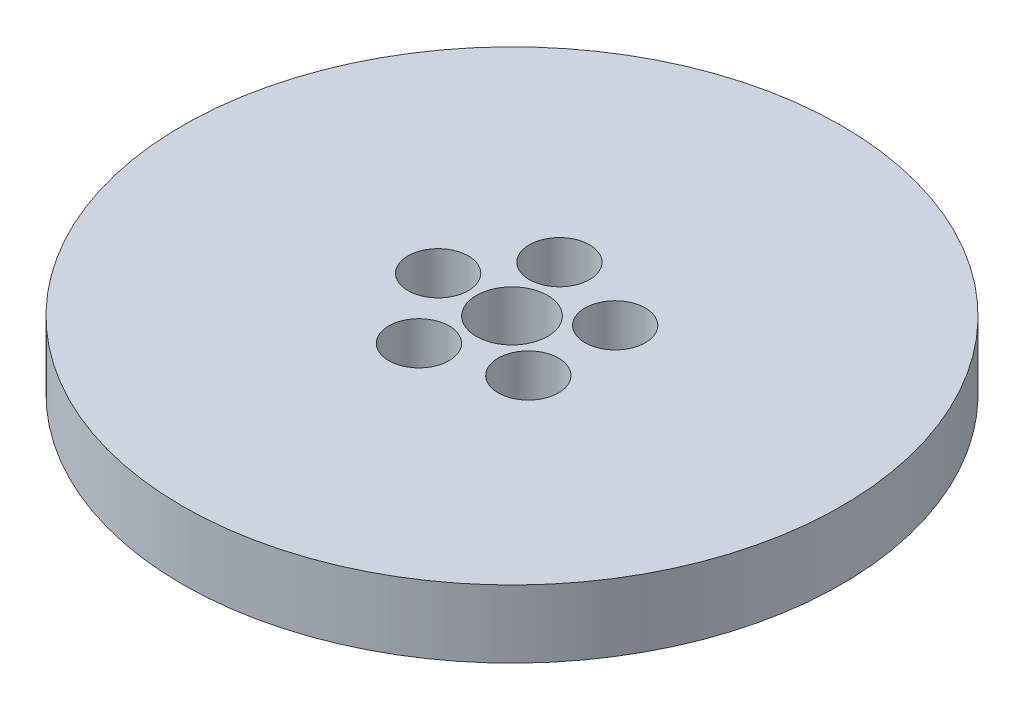
ISO-10303-21;
HEADER;
FILE_DESCRIPTION(('STEP AP214'),'2;1');
FILE_NAME('part.step','',(''),(''),'','','');
FILE_SCHEMA(('AUTOMOTIVE_DESIGN { 1 0 10303 214 1 1 1 1 }'));
ENDSEC;
DATA;
#1=APPLICATION_CONTEXT('core data for automotive mechanical design processes');
#2=APPLICATION_PROTOCOL_DEFINITION('international standard','automotive_design',2000,#1);
#3=PRODUCT_CONTEXT('',#1,'mechanical');
#4=PRODUCT('Part','Part','',(#3));
#5=PRODUCT_RELATED_PRODUCT_CATEGORY('part','',(#4));
#6=PRODUCT_DEFINITION_FORMATION('','',#4);
#7=PRODUCT_DEFINITION_CONTEXT('part definition',#1,'design');
#8=PRODUCT_DEFINITION('design','',#6,#7);
#9=PRODUCT_DEFINITION_SHAPE('','',#8);
#10=(LENGTH_UNIT() NAMED_UNIT(*) SI_UNIT(.MILLI.,.METRE.));
#11=(NAMED_UNIT(*) PLANE_ANGLE_UNIT() SI_UNIT($,.RADIAN.));
#12=(NAMED_UNIT(*) SI_UNIT($,.STERADIAN.) SOLID_ANGLE_UNIT());
#13=UNCERTAINTY_MEASURE_WITH_UNIT(LENGTH_MEASURE(1.E-05),#10,'distance_accuracy_value','');
#14=(GEOMETRIC_REPRESENTATION_CONTEXT(3) GLOBAL_UNCERTAINTY_ASSIGNED_CONTEXT((#13)) GLOBAL_UNIT_ASSIGNED_CONTEXT((#10,
#11,#12)) REPRESENTATION_CONTEXT('',''));
#15=CARTESIAN_POINT('',(0.,0.,0.));
#16=DIRECTION('',(0.,0.,1.));
#17=DIRECTION('',(1.,0.,0.));
#18=AXIS2_PLACEMENT_3D('',#15,#16,#17);
#19=CARTESIAN_POINT('',(0.,19.,0.));
#20=DIRECTION('',(0.,-1.,0.));
#21=DIRECTION('',(0.,0.,-1.));
#22=AXIS2_PLACEMENT_3D('',#19,#20,#21);
#23=CYLINDRICAL_SURFACE('',#22,92.5);
#24=CARTESIAN_POINT('',(0.,19.,0.));
#25=DIRECTION('',(0.,1.,0.));
#26=DIRECTION('',(0.,0.,1.));
#27=AXIS2_PLACEMENT_3D('',#24,#25,#26);
#28=CIRCLE('',#27,92.5);
#29=CARTESIAN_POINT('',(0.,19.,92.5));
#30=VERTEX_POINT('',#29);
#31=EDGE_CURVE('E10',#30,#30,#28,.T.);
#32=ORIENTED_EDGE('',*,*,#31,.F.);
#33=EDGE_LOOP('',(#32));
#34=FACE_BOUND('',#33,.T.);
#35=CARTESIAN_POINT('',(0.,0.,0.));
#36=DIRECTION('',(0.,1.,0.));
#37=DIRECTION('',(0.,0.,1.));
#38=AXIS2_PLACEMENT_3D('',#35,#36,#37);
#39=CIRCLE('',#38,92.5);
#40=CARTESIAN_POINT('',(0.,0.,92.5));
#41=VERTEX_POINT('',#40);
#42=EDGE_CURVE('E37',#41,#41,#39,.T.);
#43=ORIENTED_EDGE('',*,*,#42,.T.);
#44=EDGE_LOOP('',(#43));
#45=FACE_BOUND('',#44,.T.);
#46=ADVANCED_FACE('F40',(#34,#45),#23,.T.);
#47=CARTESIAN_POINT('',(0.,19.,0.));
#48=DIRECTION('',(0.,1.,0.));
#49=DIRECTION('',(0.,0.,1.));
#50=AXIS2_PLACEMENT_3D('',#47,#48,#49);
#51=PLANE('',#50);
#52=CARTESIAN_POINT('',(-6.40635530356194,19.,-19.7167342510672));
#53=DIRECTION('',(0.,1.,0.));
#54=DIRECTION('',(-0.95105651629515,0.,0.309016994374958));
#55=AXIS2_PLACEMENT_3D('',#52,#53,#54);
#56=CIRCLE('',#55,8.47070646672109);
#57=CARTESIAN_POINT('',(-6.40635530356194,19.,-11.2460277843461));
#58=VERTEX_POINT('',#57);
#59=EDGE_CURVE('E70',#58,#58,#56,.T.);
#60=ORIENTED_EDGE('',*,*,#59,.F.);
#61=EDGE_LOOP('',(#60));
#62=FACE_BOUND('',#61,.T.);
#63=CARTESIAN_POINT('',(16.7720559287326,19.,-12.1856119143089));
#64=DIRECTION('',(0.,1.,0.));
#65=DIRECTION('',(-0.58778525229248,0.,-0.809016994374942));
#66=AXIS2_PLACEMENT_3D('',#63,#64,#65);
#67=CIRCLE('',#66,8.47070646672109);
#68=CARTESIAN_POINT('',(16.7720559287326,19.,-3.71490544758783));
#69=VERTEX_POINT('',#68);
#70=EDGE_CURVE('E71',#69,#69,#67,.T.);
#71=ORIENTED_EDGE('',*,*,#70,.F.);
#72=EDGE_LOOP('',(#71));
#73=FACE_BOUND('',#72,.T.);
#74=CARTESIAN_POINT('',(16.7720559287328,19.,12.1856119143087));
#75=DIRECTION('',(0.,1.,0.));
#76=DIRECTION('',(0.587785252292469,0.,-0.809016994374951));
#77=AXIS2_PLACEMENT_3D('',#74,#75,#76);
#78=CIRCLE('',#77,8.47070646672109);
#79=CARTESIAN_POINT('',(16.7720559287328,19.,20.6563183810298));
#80=VERTEX_POINT('',#79);
#81=EDGE_CURVE('E78',#80,#80,#78,.T.);
#82=ORIENTED_EDGE('',*,*,#81,.F.);
#83=EDGE_LOOP('',(#82));
#84=FACE_BOUND('',#83,.T.);
#85=CARTESIAN_POINT('',(-6.40635530356166,19.,19.7167342510673));
#86=DIRECTION('',(0.,1.,0.));
#87=DIRECTION('',(0.951056516295155,0.,0.309016994374945));
#88=AXIS2_PLACEMENT_3D('',#85,#86,#87);
#89=CIRCLE('',#88,8.47070646672109);
#90=CARTESIAN_POINT('',(-6.40635530356166,19.,28.1874407177884));
#91=VERTEX_POINT('',#90);
#92=EDGE_CURVE('E61',#91,#91,#89,.T.);
#93=ORIENTED_EDGE('',*,*,#92,.F.);
#94=EDGE_LOOP('',(#93));
#95=FACE_BOUND('',#94,.T.);
#96=CARTESIAN_POINT('',(-20.731401250342,19.,0.));
#97=DIRECTION('',(0.,1.,0.));
#98=DIRECTION('',(0.,0.,1.));
#99=AXIS2_PLACEMENT_3D('',#96,#97,#98);
#100=CIRCLE('',#99,8.47070646672109);
#101=CARTESIAN_POINT('',(-20.731401250342,19.,8.47070646672109));
#102=VERTEX_POINT('',#101);
#103=EDGE_CURVE('E54',#102,#102,#100,.T.);
#104=ORIENTED_EDGE('',*,*,#103,.F.);
#105=EDGE_LOOP('',(#104));
#106=FACE_BOUND('',#105,.T.);
#107=CARTESIAN_POINT('',(0.,19.,0.));
#108=DIRECTION('',(0.,1.,0.));
#109=DIRECTION('',(0.,0.,1.));
#110=AXIS2_PLACEMENT_3D('',#107,#108,#109);
#111=CIRCLE('',#110,10.);
#112=CARTESIAN_POINT('',(0.,19.,10.));
#113=VERTEX_POINT('',#112);
#114=EDGE_CURVE('E50',#113,#113,#111,.T.);
#115=ORIENTED_EDGE('',*,*,#114,.F.);
#116=EDGE_LOOP('',(#115));
#117=FACE_BOUND('',#116,.T.);
#118=ORIENTED_EDGE('',*,*,#31,.T.);
#119=EDGE_LOOP('',(#118));
#120=FACE_BOUND('',#119,.T.);
#121=ADVANCED_FACE('F94',(#62,#73,#84,#95,#106,#117,#120),#51,.T.);
#122=CARTESIAN_POINT('',(0.,0.,0.));
#123=DIRECTION('',(0.,1.,0.));
#124=DIRECTION('',(0.,0.,1.));
#125=AXIS2_PLACEMENT_3D('',#122,#123,#124);
#126=PLANE('',#125);
#127=CARTESIAN_POINT('',(0.,0.,0.));
#128=DIRECTION('',(0.,1.,0.));
#129=DIRECTION('',(0.,0.,1.));
#130=AXIS2_PLACEMENT_3D('',#127,#128,#129);
#131=CIRCLE('',#130,10.);
#132=CARTESIAN_POINT('',(0.,0.,10.));
#133=VERTEX_POINT('',#132);
#134=EDGE_CURVE('E47',#133,#133,#131,.T.);
#135=ORIENTED_EDGE('',*,*,#134,.T.);
#136=EDGE_LOOP('',(#135));
#137=FACE_BOUND('',#136,.T.);
#138=ORIENTED_EDGE('',*,*,#42,.F.);
#139=EDGE_LOOP('',(#138));
#140=FACE_BOUND('',#139,.T.);
#141=ADVANCED_FACE('F100',(#137,#140),#126,.F.);
#142=CARTESIAN_POINT('',(0.,19.,0.));
#143=DIRECTION('',(0.,-1.,0.));
#144=DIRECTION('',(0.,0.,-1.));
#145=AXIS2_PLACEMENT_3D('',#142,#143,#144);
#146=CYLINDRICAL_SURFACE('',#145,10.);
#147=ORIENTED_EDGE('',*,*,#114,.T.);
#148=EDGE_LOOP('',(#147));
#149=FACE_BOUND('',#148,.T.);
#150=ORIENTED_EDGE('',*,*,#134,.F.);
#151=EDGE_LOOP('',(#150));
#152=FACE_BOUND('',#151,.T.);
#153=ADVANCED_FACE('F106',(#149,#152),#146,.F.);
#154=CARTESIAN_POINT('',(-20.731401250342,6.42580363866504,0.));
#155=DIRECTION('',(0.,1.,0.));
#156=DIRECTION('',(0.,0.,1.));
#157=AXIS2_PLACEMENT_3D('',#154,#155,#156);
#158=CYLINDRICAL_SURFACE('',#157,8.47070646672109);
#159=CARTESIAN_POINT('',(-20.731401250342,6.42580363866504,0.));
#160=DIRECTION('',(0.,1.,0.));
#161=DIRECTION('',(0.,0.,1.));
#162=AXIS2_PLACEMENT_3D('',#159,#160,#161);
#163=CIRCLE('',#162,8.47070646672109);
#164=CARTESIAN_POINT('',(-20.731401250342,6.42580363866504,8.47070646672109));
#165=VERTEX_POINT('',#164);
#166=EDGE_CURVE('E55',#165,#165,#163,.T.);
#167=CARTESIAN_POINT('',(-20.731401250342,6.42580363866504,8.47070646672109));
#168=CARTESIAN_POINT('',(-20.731401250342,6.55678485076228,8.47070646672109));
#169=CARTESIAN_POINT('',(-20.731401250342,6.68776606285952,8.47070646672109));
#170=CARTESIAN_POINT('',(-20.731401250342,6.949728487054,8.47070646672109));
#171=CARTESIAN_POINT('',(-20.731401250342,7.08070969915124,8.47070646672109));
#172=CARTESIAN_POINT('',(-20.731401250342,7.34267212334572,8.47070646672109));
#173=CARTESIAN_POINT('',(-20.731401250342,7.47365333544296,8.47070646672109));
#174=CARTESIAN_POINT('',(-20.731401250342,7.73561575963743,8.47070646672109));
#175=CARTESIAN_POINT('',(-20.731401250342,7.86659697173467,8.47070646672109));
#176=CARTESIAN_POINT('',(-20.731401250342,8.12855939592915,8.47070646672109));
#177=CARTESIAN_POINT('',(-20.731401250342,8.25954060802639,8.47070646672109));
#178=CARTESIAN_POINT('',(-20.731401250342,8.52150303222087,8.47070646672109));
#179=CARTESIAN_POINT('',(-20.731401250342,8.65248424431811,8.47070646672109));
#180=CARTESIAN_POINT('',(-20.731401250342,8.91444666851259,8.47070646672109));
#181=CARTESIAN_POINT('',(-20.731401250342,9.04542788060983,8.47070646672109));
#182=CARTESIAN_POINT('',(-20.731401250342,9.3073903048043,8.47070646672109));
#183=CARTESIAN_POINT('',(-20.731401250342,9.43837151690154,8.47070646672109));
#184=CARTESIAN_POINT('',(-20.731401250342,9.70033394109602,8.47070646672109));
#185=CARTESIAN_POINT('',(-20.731401250342,9.83131515319326,8.47070646672109));
#186=CARTESIAN_POINT('',(-20.731401250342,10.0932775773877,8.47070646672109));
#187=CARTESIAN_POINT('',(-20.731401250342,10.224258789485,8.47070646672109));
#188=CARTESIAN_POINT('',(-20.731401250342,10.4862212136795,8.47070646672109));
#189=CARTESIAN_POINT('',(-20.731401250342,10.6172024257767,8.47070646672109));
#190=CARTESIAN_POINT('',(-20.731401250342,10.8791648499712,8.47070646672109));
#191=CARTESIAN_POINT('',(-20.731401250342,11.0101460620684,8.47070646672109));
#192=CARTESIAN_POINT('',(-20.731401250342,11.2721084862629,8.47070646672109));
#193=CARTESIAN_POINT('',(-20.731401250342,11.4030896983601,8.47070646672109));
#194=CARTESIAN_POINT('',(-20.731401250342,11.6650521225546,8.47070646672109));
#195=CARTESIAN_POINT('',(-20.731401250342,11.7960333346518,8.47070646672109));
#196=CARTESIAN_POINT('',(-20.731401250342,12.0579957588463,8.47070646672109));
#197=CARTESIAN_POINT('',(-20.731401250342,12.1889769709436,8.47070646672109));
#198=CARTESIAN_POINT('',(-20.731401250342,12.450939395138,8.47070646672109));
#199=CARTESIAN_POINT('',(-20.731401250342,12.5819206072353,8.47070646672109));
#200=CARTESIAN_POINT('',(-20.731401250342,12.8438830314298,8.47070646672109));
#201=CARTESIAN_POINT('',(-20.731401250342,12.974864243527,8.47070646672109));
#202=CARTESIAN_POINT('',(-20.731401250342,13.2368266677215,8.47070646672109));
#203=CARTESIAN_POINT('',(-20.731401250342,13.3678078798187,8.47070646672109));
#204=CARTESIAN_POINT('',(-20.731401250342,13.6297703040132,8.47070646672109));
#205=CARTESIAN_POINT('',(-20.731401250342,13.7607515161104,8.47070646672109));
#206=CARTESIAN_POINT('',(-20.731401250342,14.0227139403049,8.47070646672109));
#207=CARTESIAN_POINT('',(-20.731401250342,14.1536951524022,8.47070646672109));
#208=CARTESIAN_POINT('',(-20.731401250342,14.4156575765966,8.47070646672109));
#209=CARTESIAN_POINT('',(-20.731401250342,14.5466387886939,8.47070646672109));
#210=CARTESIAN_POINT('',(-20.731401250342,14.8086012128883,8.47070646672109));
#211=CARTESIAN_POINT('',(-20.731401250342,14.9395824249856,8.47070646672109));
#212=CARTESIAN_POINT('',(-20.731401250342,15.2015448491801,8.47070646672109));
#213=CARTESIAN_POINT('',(-20.731401250342,15.3325260612773,8.47070646672109));
#214=CARTESIAN_POINT('',(-20.731401250342,15.5944884854718,8.47070646672109));
#215=CARTESIAN_POINT('',(-20.731401250342,15.725469697569,8.47070646672109));
#216=CARTESIAN_POINT('',(-20.731401250342,15.9874321217635,8.47070646672109));
#217=CARTESIAN_POINT('',(-20.731401250342,16.1184133338607,8.47070646672109));
#218=CARTESIAN_POINT('',(-20.731401250342,16.3803757580552,8.47070646672109));
#219=CARTESIAN_POINT('',(-20.731401250342,16.5113569701525,8.47070646672109));
#220=CARTESIAN_POINT('',(-20.731401250342,16.7733193943469,8.47070646672109));
#221=CARTESIAN_POINT('',(-20.731401250342,16.9043006064442,8.47070646672109));
#222=CARTESIAN_POINT('',(-20.731401250342,17.1662630306387,8.47070646672109));
#223=CARTESIAN_POINT('',(-20.731401250342,17.2972442427359,8.47070646672109));
#224=CARTESIAN_POINT('',(-20.731401250342,17.5592066669304,8.47070646672109));
#225=CARTESIAN_POINT('',(-20.731401250342,17.6901878790276,8.47070646672109));
#226=CARTESIAN_POINT('',(-20.731401250342,17.9521503032221,8.47070646672109));
#227=CARTESIAN_POINT('',(-20.731401250342,18.0831315153193,8.47070646672109));
#228=CARTESIAN_POINT('',(-20.731401250342,18.3450939395138,8.47070646672109));
#229=CARTESIAN_POINT('',(-20.731401250342,18.476075151611,8.47070646672109));
#230=CARTESIAN_POINT('',(-20.731401250342,18.7380375758055,8.47070646672109));
#231=CARTESIAN_POINT('',(-20.731401250342,18.8690187879028,8.47070646672109));
#232=CARTESIAN_POINT('',(-20.731401250342,19.,8.47070646672109));
#233=B_SPLINE_CURVE_WITH_KNOTS('',3,(#167,#168,#169,#170,#171,#172,#173,#174,#175,#176,#177,
#178,#179,#180,#181,#182,#183,#184,#185,#186,#187,#188,#189,#190,#191,#192,#193,#194,#195,#196,
#197,#198,#199,#200,#201,#202,#203,#204,#205,#206,#207,#208,#209,#210,#211,#212,#213,#214,#215,
#216,#217,#218,#219,#220,#221,#222,#223,#224,#225,#226,#227,#228,#229,#230,#231,#232),
.UNSPECIFIED.,.F.,.F.,(4,2,2,2,2,2,2,2,2,2,2,2,2,2,2,2,2,2,2,2,2,2,2,2,2,2,2,2,2,2,2,2,4),(0.,
0.392943636291718,0.785887272583435,1.17883090887515,1.57177454516687,1.96471818145859,
2.3576618177503,2.75060545404202,3.14354909033374,3.53649272662546,3.92943636291717,
4.32237999920889,4.71532363550061,5.10826727179233,5.50121090808404,5.89415454437576,
6.28709818066748,6.68004181695919,7.07298545325091,7.46592908954263,7.85887272583435,
8.25181636212606,8.64475999841778,9.0377036347095,9.43064727100122,9.82359090729293,
10.2165345435847,10.6094781798764,11.0024218161681,11.3953654524598,11.7883090887515,
12.1812527250432,12.574196361335),.UNSPECIFIED.);
#234=EDGE_CURVE('BSEAM108',#165,#102,#233,.T.);
#235=ORIENTED_EDGE('',*,*,#166,.F.);
#236=ORIENTED_EDGE('',*,*,#103,.T.);
#237=ORIENTED_EDGE('',*,*,#234,.T.);
#238=ORIENTED_EDGE('',*,*,#234,.F.);
#239=EDGE_LOOP('',(#235,#237,#236,#238));
#240=FACE_BOUND('',#239,.T.);
#241=ADVANCED_FACE('F108',(#240),#158,.F.);
#242=CARTESIAN_POINT('',(-20.731401250342,6.42580363866504,0.));
#243=DIRECTION('',(0.,1.,0.));
#244=DIRECTION('',(0.,0.,1.));
#245=AXIS2_PLACEMENT_3D('',#242,#243,#244);
#246=PLANE('',#245);
#247=ORIENTED_EDGE('',*,*,#166,.T.);
#248=EDGE_LOOP('',(#247));
#249=FACE_BOUND('',#248,.T.);
#250=ADVANCED_FACE('F138',(#249),#246,.T.);
#251=CARTESIAN_POINT('',(-6.40635530356166,6.42580363866504,19.7167342510673));
#252=DIRECTION('',(0.,1.,0.));
#253=DIRECTION('',(0.,0.,1.));
#254=AXIS2_PLACEMENT_3D('',#251,#252,#253);
#255=CYLINDRICAL_SURFACE('',#254,8.47070646672109);
#256=CARTESIAN_POINT('',(-6.40635530356166,6.42580363866504,19.7167342510673));
#257=DIRECTION('',(0.,1.,0.));
#258=DIRECTION('',(0.951056516295155,0.,0.309016994374945));
#259=AXIS2_PLACEMENT_3D('',#256,#257,#258);
#260=CIRCLE('',#259,8.47070646672109);
#261=CARTESIAN_POINT('',(-6.40635530356166,6.42580363866504,28.1874407177884));
#262=VERTEX_POINT('',#261);
#263=EDGE_CURVE('E59',#262,#262,#260,.T.);
#264=CARTESIAN_POINT('',(-6.40635530356166,6.42580363866504,28.1874407177884));
#265=CARTESIAN_POINT('',(-6.40635530356166,6.55678485076228,28.1874407177884));
#266=CARTESIAN_POINT('',(-6.40635530356166,6.68776606285952,28.1874407177884));
#267=CARTESIAN_POINT('',(-6.40635530356166,6.949728487054,28.1874407177884));
#268=CARTESIAN_POINT('',(-6.40635530356166,7.08070969915124,28.1874407177884));
#269=CARTESIAN_POINT('',(-6.40635530356166,7.34267212334572,28.1874407177884));
#270=CARTESIAN_POINT('',(-6.40635530356166,7.47365333544296,28.1874407177884));
#271=CARTESIAN_POINT('',(-6.40635530356166,7.73561575963743,28.1874407177884));
#272=CARTESIAN_POINT('',(-6.40635530356166,7.86659697173467,28.1874407177884));
#273=CARTESIAN_POINT('',(-6.40635530356166,8.12855939592915,28.1874407177884));
#274=CARTESIAN_POINT('',(-6.40635530356166,8.25954060802639,28.1874407177884));
#275=CARTESIAN_POINT('',(-6.40635530356166,8.52150303222087,28.1874407177884));
#276=CARTESIAN_POINT('',(-6.40635530356166,8.65248424431811,28.1874407177884));
#277=CARTESIAN_POINT('',(-6.40635530356166,8.91444666851259,28.1874407177884));
#278=CARTESIAN_POINT('',(-6.40635530356166,9.04542788060983,28.1874407177884));
#279=CARTESIAN_POINT('',(-6.40635530356166,9.3073903048043,28.1874407177884));
#280=CARTESIAN_POINT('',(-6.40635530356166,9.43837151690154,28.1874407177884));
#281=CARTESIAN_POINT('',(-6.40635530356166,9.70033394109602,28.1874407177884));
#282=CARTESIAN_POINT('',(-6.40635530356166,9.83131515319326,28.1874407177884));
#283=CARTESIAN_POINT('',(-6.40635530356166,10.0932775773877,28.1874407177884));
#284=CARTESIAN_POINT('',(-6.40635530356166,10.224258789485,28.1874407177884));
#285=CARTESIAN_POINT('',(-6.40635530356166,10.4862212136795,28.1874407177884));
#286=CARTESIAN_POINT('',(-6.40635530356166,10.6172024257767,28.1874407177884));
#287=CARTESIAN_POINT('',(-6.40635530356166,10.8791648499712,28.1874407177884));
#288=CARTESIAN_POINT('',(-6.40635530356166,11.0101460620684,28.1874407177884));
#289=CARTESIAN_POINT('',(-6.40635530356166,11.2721084862629,28.1874407177884));
#290=CARTESIAN_POINT('',(-6.40635530356166,11.4030896983601,28.1874407177884));
#291=CARTESIAN_POINT('',(-6.40635530356166,11.6650521225546,28.1874407177884));
#292=CARTESIAN_POINT('',(-6.40635530356166,11.7960333346518,28.1874407177884));
#293=CARTESIAN_POINT('',(-6.40635530356166,12.0579957588463,28.1874407177884));
#294=CARTESIAN_POINT('',(-6.40635530356166,12.1889769709436,28.1874407177884));
#295=CARTESIAN_POINT('',(-6.40635530356166,12.450939395138,28.1874407177884));
#296=CARTESIAN_POINT('',(-6.40635530356166,12.5819206072353,28.1874407177884));
#297=CARTESIAN_POINT('',(-6.40635530356166,12.8438830314298,28.1874407177884));
#298=CARTESIAN_POINT('',(-6.40635530356166,12.974864243527,28.1874407177884));
#299=CARTESIAN_POINT('',(-6.40635530356166,13.2368266677215,28.1874407177884));
#300=CARTESIAN_POINT('',(-6.40635530356166,13.3678078798187,28.1874407177884));
#301=CARTESIAN_POINT('',(-6.40635530356166,13.6297703040132,28.1874407177884));
#302=CARTESIAN_POINT('',(-6.40635530356166,13.7607515161104,28.1874407177884));
#303=CARTESIAN_POINT('',(-6.40635530356166,14.0227139403049,28.1874407177884));
#304=CARTESIAN_POINT('',(-6.40635530356166,14.1536951524022,28.1874407177884));
#305=CARTESIAN_POINT('',(-6.40635530356166,14.4156575765966,28.1874407177884));
#306=CARTESIAN_POINT('',(-6.40635530356166,14.5466387886939,28.1874407177884));
#307=CARTESIAN_POINT('',(-6.40635530356166,14.8086012128883,28.1874407177884));
#308=CARTESIAN_POINT('',(-6.40635530356166,14.9395824249856,28.1874407177884));
#309=CARTESIAN_POINT('',(-6.40635530356166,15.2015448491801,28.1874407177884));
#310=CARTESIAN_POINT('',(-6.40635530356166,15.3325260612773,28.1874407177884));
#311=CARTESIAN_POINT('',(-6.40635530356166,15.5944884854718,28.1874407177884));
#312=CARTESIAN_POINT('',(-6.40635530356166,15.725469697569,28.1874407177884));
#313=CARTESIAN_POINT('',(-6.40635530356166,15.9874321217635,28.1874407177884));
#314=CARTESIAN_POINT('',(-6.40635530356166,16.1184133338607,28.1874407177884));
#315=CARTESIAN_POINT('',(-6.40635530356166,16.3803757580552,28.1874407177884));
#316=CARTESIAN_POINT('',(-6.40635530356166,16.5113569701525,28.1874407177884));
#317=CARTESIAN_POINT('',(-6.40635530356166,16.7733193943469,28.1874407177884));
#318=CARTESIAN_POINT('',(-6.40635530356166,16.9043006064442,28.1874407177884));
#319=CARTESIAN_POINT('',(-6.40635530356166,17.1662630306387,28.1874407177884));
#320=CARTESIAN_POINT('',(-6.40635530356166,17.2972442427359,28.1874407177884));
#321=CARTESIAN_POINT('',(-6.40635530356166,17.5592066669304,28.1874407177884));
#322=CARTESIAN_POINT('',(-6.40635530356166,17.6901878790276,28.1874407177884));
#323=CARTESIAN_POINT('',(-6.40635530356166,17.9521503032221,28.1874407177884));
#324=CARTESIAN_POINT('',(-6.40635530356166,18.0831315153193,28.1874407177884));
#325=CARTESIAN_POINT('',(-6.40635530356166,18.3450939395138,28.1874407177884));
#326=CARTESIAN_POINT('',(-6.40635530356166,18.476075151611,28.1874407177884));
#327=CARTESIAN_POINT('',(-6.40635530356166,18.7380375758055,28.1874407177884));
#328=CARTESIAN_POINT('',(-6.40635530356166,18.8690187879028,28.1874407177884));
#329=CARTESIAN_POINT('',(-6.40635530356166,19.,28.1874407177884));
#330=B_SPLINE_CURVE_WITH_KNOTS('',3,(#264,#265,#266,#267,#268,#269,#270,#271,#272,#273,#274,
#275,#276,#277,#278,#279,#280,#281,#282,#283,#284,#285,#286,#287,#288,#289,#290,#291,#292,#293,
#294,#295,#296,#297,#298,#299,#300,#301,#302,#303,#304,#305,#306,#307,#308,#309,#310,#311,#312,
#313,#314,#315,#316,#317,#318,#319,#320,#321,#322,#323,#324,#325,#326,#327,#328,#329),
.UNSPECIFIED.,.F.,.F.,(4,2,2,2,2,2,2,2,2,2,2,2,2,2,2,2,2,2,2,2,2,2,2,2,2,2,2,2,2,2,2,2,4),(0.,
0.392943636291718,0.785887272583435,1.17883090887515,1.57177454516687,1.96471818145859,
2.3576618177503,2.75060545404202,3.14354909033374,3.53649272662546,3.92943636291717,
4.32237999920889,4.71532363550061,5.10826727179233,5.50121090808404,5.89415454437576,
6.28709818066748,6.68004181695919,7.07298545325091,7.46592908954263,7.85887272583435,
8.25181636212606,8.64475999841778,9.0377036347095,9.43064727100122,9.82359090729293,
10.2165345435847,10.6094781798764,11.0024218161681,11.3953654524598,11.7883090887515,
12.1812527250432,12.574196361335),.UNSPECIFIED.);
#331=EDGE_CURVE('BSEAM150',#262,#91,#330,.T.);
#332=ORIENTED_EDGE('',*,*,#263,.F.);
#333=ORIENTED_EDGE('',*,*,#92,.T.);
#334=ORIENTED_EDGE('',*,*,#331,.T.);
#335=ORIENTED_EDGE('',*,*,#331,.F.);
#336=EDGE_LOOP('',(#332,#334,#333,#335));
#337=FACE_BOUND('',#336,.T.);
#338=ADVANCED_FACE('F150',(#337),#255,.F.);
#339=CARTESIAN_POINT('',(-6.40635530356166,6.42580363866504,19.7167342510673));
#340=DIRECTION('',(0.,1.,0.));
#341=DIRECTION('',(0.951056516295155,0.,0.309016994374945));
#342=AXIS2_PLACEMENT_3D('',#339,#340,#341);
#343=PLANE('',#342);
#344=ORIENTED_EDGE('',*,*,#263,.T.);
#345=EDGE_LOOP('',(#344));
#346=FACE_BOUND('',#345,.T.);
#347=ADVANCED_FACE('F89',(#346),#343,.T.);
#348=CARTESIAN_POINT('',(16.7720559287328,6.42580363866504,12.1856119143087));
#349=DIRECTION('',(0.,1.,0.));
#350=DIRECTION('',(0.,0.,1.));
#351=AXIS2_PLACEMENT_3D('',#348,#349,#350);
#352=CYLINDRICAL_SURFACE('',#351,8.47070646672109);
#353=CARTESIAN_POINT('',(16.7720559287328,6.42580363866504,12.1856119143087));
#354=DIRECTION('',(0.,1.,0.));
#355=DIRECTION('',(0.587785252292469,0.,-0.809016994374951));
#356=AXIS2_PLACEMENT_3D('',#353,#354,#355);
#357=CIRCLE('',#356,8.47070646672109);
#358=CARTESIAN_POINT('',(16.7720559287328,6.42580363866504,20.6563183810298));
#359=VERTEX_POINT('',#358);
#360=EDGE_CURVE('E63',#359,#359,#357,.T.);
#361=CARTESIAN_POINT('',(16.7720559287328,6.42580363866504,20.6563183810298));
#362=CARTESIAN_POINT('',(16.7720559287328,6.55678485076228,20.6563183810298));
#363=CARTESIAN_POINT('',(16.7720559287328,6.68776606285952,20.6563183810298));
#364=CARTESIAN_POINT('',(16.7720559287328,6.949728487054,20.6563183810298));
#365=CARTESIAN_POINT('',(16.7720559287328,7.08070969915124,20.6563183810298));
#366=CARTESIAN_POINT('',(16.7720559287328,7.34267212334572,20.6563183810298));
#367=CARTESIAN_POINT('',(16.7720559287328,7.47365333544296,20.6563183810298));
#368=CARTESIAN_POINT('',(16.7720559287328,7.73561575963743,20.6563183810298));
#369=CARTESIAN_POINT('',(16.7720559287328,7.86659697173467,20.6563183810298));
#370=CARTESIAN_POINT('',(16.7720559287328,8.12855939592915,20.6563183810298));
#371=CARTESIAN_POINT('',(16.7720559287328,8.25954060802639,20.6563183810298));
#372=CARTESIAN_POINT('',(16.7720559287328,8.52150303222087,20.6563183810298));
#373=CARTESIAN_POINT('',(16.7720559287328,8.65248424431811,20.6563183810298));
#374=CARTESIAN_POINT('',(16.7720559287328,8.91444666851259,20.6563183810298));
#375=CARTESIAN_POINT('',(16.7720559287328,9.04542788060983,20.6563183810298));
#376=CARTESIAN_POINT('',(16.7720559287328,9.3073903048043,20.6563183810298));
#377=CARTESIAN_POINT('',(16.7720559287328,9.43837151690154,20.6563183810298));
#378=CARTESIAN_POINT('',(16.7720559287328,9.70033394109602,20.6563183810298));
#379=CARTESIAN_POINT('',(16.7720559287328,9.83131515319326,20.6563183810298));
#380=CARTESIAN_POINT('',(16.7720559287328,10.0932775773877,20.6563183810298));
#381=CARTESIAN_POINT('',(16.7720559287328,10.224258789485,20.6563183810298));
#382=CARTESIAN_POINT('',(16.7720559287328,10.4862212136795,20.6563183810298));
#383=CARTESIAN_POINT('',(16.7720559287328,10.6172024257767,20.6563183810298));
#384=CARTESIAN_POINT('',(16.7720559287328,10.8791648499712,20.6563183810298));
#385=CARTESIAN_POINT('',(16.7720559287328,11.0101460620684,20.6563183810298));
#386=CARTESIAN_POINT('',(16.7720559287328,11.2721084862629,20.6563183810298));
#387=CARTESIAN_POINT('',(16.7720559287328,11.4030896983601,20.6563183810298));
#388=CARTESIAN_POINT('',(16.7720559287328,11.6650521225546,20.6563183810298));
#389=CARTESIAN_POINT('',(16.7720559287328,11.7960333346518,20.6563183810298));
#390=CARTESIAN_POINT('',(16.7720559287328,12.0579957588463,20.6563183810298));
#391=CARTESIAN_POINT('',(16.7720559287328,12.1889769709436,20.6563183810298));
#392=CARTESIAN_POINT('',(16.7720559287328,12.450939395138,20.6563183810298));
#393=CARTESIAN_POINT('',(16.7720559287328,12.5819206072353,20.6563183810298));
#394=CARTESIAN_POINT('',(16.7720559287328,12.8438830314298,20.6563183810298));
#395=CARTESIAN_POINT('',(16.7720559287328,12.974864243527,20.6563183810298));
#396=CARTESIAN_POINT('',(16.7720559287328,13.2368266677215,20.6563183810298));
#397=CARTESIAN_POINT('',(16.7720559287328,13.3678078798187,20.6563183810298));
#398=CARTESIAN_POINT('',(16.7720559287328,13.6297703040132,20.6563183810298));
#399=CARTESIAN_POINT('',(16.7720559287328,13.7607515161104,20.6563183810298));
#400=CARTESIAN_POINT('',(16.7720559287328,14.0227139403049,20.6563183810298));
#401=CARTESIAN_POINT('',(16.7720559287328,14.1536951524022,20.6563183810298));
#402=CARTESIAN_POINT('',(16.7720559287328,14.4156575765966,20.6563183810298));
#403=CARTESIAN_POINT('',(16.7720559287328,14.5466387886939,20.6563183810298));
#404=CARTESIAN_POINT('',(16.7720559287328,14.8086012128883,20.6563183810298));
#405=CARTESIAN_POINT('',(16.7720559287328,14.9395824249856,20.6563183810298));
#406=CARTESIAN_POINT('',(16.7720559287328,15.2015448491801,20.6563183810298));
#407=CARTESIAN_POINT('',(16.7720559287328,15.3325260612773,20.6563183810298));
#408=CARTESIAN_POINT('',(16.7720559287328,15.5944884854718,20.6563183810298));
#409=CARTESIAN_POINT('',(16.7720559287328,15.725469697569,20.6563183810298));
#410=CARTESIAN_POINT('',(16.7720559287328,15.9874321217635,20.6563183810298));
#411=CARTESIAN_POINT('',(16.7720559287328,16.1184133338607,20.6563183810298));
#412=CARTESIAN_POINT('',(16.7720559287328,16.3803757580552,20.6563183810298));
#413=CARTESIAN_POINT('',(16.7720559287328,16.5113569701525,20.6563183810298));
#414=CARTESIAN_POINT('',(16.7720559287328,16.7733193943469,20.6563183810298));
#415=CARTESIAN_POINT('',(16.7720559287328,16.9043006064442,20.6563183810298));
#416=CARTESIAN_POINT('',(16.7720559287328,17.1662630306387,20.6563183810298));
#417=CARTESIAN_POINT('',(16.7720559287328,17.2972442427359,20.6563183810298));
#418=CARTESIAN_POINT('',(16.7720559287328,17.5592066669304,20.6563183810298));
#419=CARTESIAN_POINT('',(16.7720559287328,17.6901878790276,20.6563183810298));
#420=CARTESIAN_POINT('',(16.7720559287328,17.9521503032221,20.6563183810298));
#421=CARTESIAN_POINT('',(16.7720559287328,18.0831315153193,20.6563183810298));
#422=CARTESIAN_POINT('',(16.7720559287328,18.3450939395138,20.6563183810298));
#423=CARTESIAN_POINT('',(16.7720559287328,18.476075151611,20.6563183810298));
#424=CARTESIAN_POINT('',(16.7720559287328,18.7380375758055,20.6563183810298));
#425=CARTESIAN_POINT('',(16.7720559287328,18.8690187879028,20.6563183810298));
#426=CARTESIAN_POINT('',(16.7720559287328,19.,20.6563183810298));
#427=B_SPLINE_CURVE_WITH_KNOTS('',3,(#361,#362,#363,#364,#365,#366,#367,#368,#369,#370,#371,
#372,#373,#374,#375,#376,#377,#378,#379,#380,#381,#382,#383,#384,#385,#386,#387,#388,#389,#390,
#391,#392,#393,#394,#395,#396,#397,#398,#399,#400,#401,#402,#403,#404,#405,#406,#407,#408,#409,
#410,#411,#412,#413,#414,#415,#416,#417,#418,#419,#420,#421,#422,#423,#424,#425,#426),
.UNSPECIFIED.,.F.,.F.,(4,2,2,2,2,2,2,2,2,2,2,2,2,2,2,2,2,2,2,2,2,2,2,2,2,2,2,2,2,2,2,2,4),(0.,
0.392943636291718,0.785887272583435,1.17883090887515,1.57177454516687,1.96471818145859,
2.3576618177503,2.75060545404202,3.14354909033374,3.53649272662546,3.92943636291717,
4.32237999920889,4.71532363550061,5.10826727179233,5.50121090808404,5.89415454437576,
6.28709818066748,6.68004181695919,7.07298545325091,7.46592908954263,7.85887272583435,
8.25181636212606,8.64475999841778,9.0377036347095,9.43064727100122,9.82359090729293,
10.2165345435847,10.6094781798764,11.0024218161681,11.3953654524598,11.7883090887515,
12.1812527250432,12.574196361335),.UNSPECIFIED.);
#428=EDGE_CURVE('BSEAM87',#359,#80,#427,.T.);
#429=ORIENTED_EDGE('',*,*,#360,.F.);
#430=ORIENTED_EDGE('',*,*,#81,.T.);
#431=ORIENTED_EDGE('',*,*,#428,.T.);
#432=ORIENTED_EDGE('',*,*,#428,.F.);
#433=EDGE_LOOP('',(#429,#431,#430,#432));
#434=FACE_BOUND('',#433,.T.);
#435=ADVANCED_FACE('F87',(#434),#352,.F.);
#436=CARTESIAN_POINT('',(16.7720559287328,6.42580363866504,12.1856119143087));
#437=DIRECTION('',(0.,1.,0.));
#438=DIRECTION('',(0.587785252292469,0.,-0.809016994374951));
#439=AXIS2_PLACEMENT_3D('',#436,#437,#438);
#440=PLANE('',#439);
#441=ORIENTED_EDGE('',*,*,#360,.T.);
#442=EDGE_LOOP('',(#441));
#443=FACE_BOUND('',#442,.T.);
#444=ADVANCED_FACE('F84',(#443),#440,.T.);
#445=CARTESIAN_POINT('',(16.7720559287326,6.42580363866504,-12.1856119143089));
#446=DIRECTION('',(0.,1.,0.));
#447=DIRECTION('',(0.,0.,1.));
#448=AXIS2_PLACEMENT_3D('',#445,#446,#447);
#449=CYLINDRICAL_SURFACE('',#448,8.47070646672109);
#450=CARTESIAN_POINT('',(16.7720559287326,6.42580363866504,-12.1856119143089));
#451=DIRECTION('',(0.,1.,0.));
#452=DIRECTION('',(-0.58778525229248,0.,-0.809016994374942));
#453=AXIS2_PLACEMENT_3D('',#450,#451,#452);
#454=CIRCLE('',#453,8.47070646672109);
#455=CARTESIAN_POINT('',(16.7720559287326,6.42580363866504,-3.71490544758783));
#456=VERTEX_POINT('',#455);
#457=EDGE_CURVE('E76',#456,#456,#454,.T.);
#458=CARTESIAN_POINT('',(16.7720559287326,6.42580363866504,-3.71490544758783));
#459=CARTESIAN_POINT('',(16.7720559287326,6.55678485076228,-3.71490544758783));
#460=CARTESIAN_POINT('',(16.7720559287326,6.68776606285952,-3.71490544758783));
#461=CARTESIAN_POINT('',(16.7720559287326,6.949728487054,-3.71490544758783));
#462=CARTESIAN_POINT('',(16.7720559287326,7.08070969915124,-3.71490544758783));
#463=CARTESIAN_POINT('',(16.7720559287326,7.34267212334572,-3.71490544758783));
#464=CARTESIAN_POINT('',(16.7720559287326,7.47365333544296,-3.71490544758783));
#465=CARTESIAN_POINT('',(16.7720559287326,7.73561575963743,-3.71490544758783));
#466=CARTESIAN_POINT('',(16.7720559287326,7.86659697173467,-3.71490544758783));
#467=CARTESIAN_POINT('',(16.7720559287326,8.12855939592915,-3.71490544758783));
#468=CARTESIAN_POINT('',(16.7720559287326,8.25954060802639,-3.71490544758783));
#469=CARTESIAN_POINT('',(16.7720559287326,8.52150303222087,-3.71490544758783));
#470=CARTESIAN_POINT('',(16.7720559287326,8.65248424431811,-3.71490544758783));
#471=CARTESIAN_POINT('',(16.7720559287326,8.91444666851259,-3.71490544758783));
#472=CARTESIAN_POINT('',(16.7720559287326,9.04542788060983,-3.71490544758783));
#473=CARTESIAN_POINT('',(16.7720559287326,9.3073903048043,-3.71490544758783));
#474=CARTESIAN_POINT('',(16.7720559287326,9.43837151690154,-3.71490544758783));
#475=CARTESIAN_POINT('',(16.7720559287326,9.70033394109602,-3.71490544758783));
#476=CARTESIAN_POINT('',(16.7720559287326,9.83131515319326,-3.71490544758783));
#477=CARTESIAN_POINT('',(16.7720559287326,10.0932775773877,-3.71490544758783));
#478=CARTESIAN_POINT('',(16.7720559287326,10.224258789485,-3.71490544758783));
#479=CARTESIAN_POINT('',(16.7720559287326,10.4862212136795,-3.71490544758783));
#480=CARTESIAN_POINT('',(16.7720559287326,10.6172024257767,-3.71490544758783));
#481=CARTESIAN_POINT('',(16.7720559287326,10.8791648499712,-3.71490544758783));
#482=CARTESIAN_POINT('',(16.7720559287326,11.0101460620684,-3.71490544758783));
#483=CARTESIAN_POINT('',(16.7720559287326,11.2721084862629,-3.71490544758783));
#484=CARTESIAN_POINT('',(16.7720559287326,11.4030896983601,-3.71490544758783));
#485=CARTESIAN_POINT('',(16.7720559287326,11.6650521225546,-3.71490544758783));
#486=CARTESIAN_POINT('',(16.7720559287326,11.7960333346518,-3.71490544758783));
#487=CARTESIAN_POINT('',(16.7720559287326,12.0579957588463,-3.71490544758783));
#488=CARTESIAN_POINT('',(16.7720559287326,12.1889769709436,-3.71490544758783));
#489=CARTESIAN_POINT('',(16.7720559287326,12.450939395138,-3.71490544758783));
#490=CARTESIAN_POINT('',(16.7720559287326,12.5819206072353,-3.71490544758783));
#491=CARTESIAN_POINT('',(16.7720559287326,12.8438830314298,-3.71490544758783));
#492=CARTESIAN_POINT('',(16.7720559287326,12.974864243527,-3.71490544758783));
#493=CARTESIAN_POINT('',(16.7720559287326,13.2368266677215,-3.71490544758783));
#494=CARTESIAN_POINT('',(16.7720559287326,13.3678078798187,-3.71490544758783));
#495=CARTESIAN_POINT('',(16.7720559287326,13.6297703040132,-3.71490544758783));
#496=CARTESIAN_POINT('',(16.7720559287326,13.7607515161104,-3.71490544758783));
#497=CARTESIAN_POINT('',(16.7720559287326,14.0227139403049,-3.71490544758783));
#498=CARTESIAN_POINT('',(16.7720559287326,14.1536951524022,-3.71490544758783));
#499=CARTESIAN_POINT('',(16.7720559287326,14.4156575765966,-3.71490544758783));
#500=CARTESIAN_POINT('',(16.7720559287326,14.5466387886939,-3.71490544758783));
#501=CARTESIAN_POINT('',(16.7720559287326,14.8086012128883,-3.71490544758783));
#502=CARTESIAN_POINT('',(16.7720559287326,14.9395824249856,-3.71490544758783));
#503=CARTESIAN_POINT('',(16.7720559287326,15.2015448491801,-3.71490544758783));
#504=CARTESIAN_POINT('',(16.7720559287326,15.3325260612773,-3.71490544758783));
#505=CARTESIAN_POINT('',(16.7720559287326,15.5944884854718,-3.71490544758783));
#506=CARTESIAN_POINT('',(16.7720559287326,15.725469697569,-3.71490544758783));
#507=CARTESIAN_POINT('',(16.7720559287326,15.9874321217635,-3.71490544758783));
#508=CARTESIAN_POINT('',(16.7720559287326,16.1184133338607,-3.71490544758783));
#509=CARTESIAN_POINT('',(16.7720559287326,16.3803757580552,-3.71490544758783));
#510=CARTESIAN_POINT('',(16.7720559287326,16.5113569701525,-3.71490544758783));
#511=CARTESIAN_POINT('',(16.7720559287326,16.7733193943469,-3.71490544758783));
#512=CARTESIAN_POINT('',(16.7720559287326,16.9043006064442,-3.71490544758783));
#513=CARTESIAN_POINT('',(16.7720559287326,17.1662630306387,-3.71490544758783));
#514=CARTESIAN_POINT('',(16.7720559287326,17.2972442427359,-3.71490544758783));
#515=CARTESIAN_POINT('',(16.7720559287326,17.5592066669304,-3.71490544758783));
#516=CARTESIAN_POINT('',(16.7720559287326,17.6901878790276,-3.71490544758783));
#517=CARTESIAN_POINT('',(16.7720559287326,17.9521503032221,-3.71490544758783));
#518=CARTESIAN_POINT('',(16.7720559287326,18.0831315153193,-3.71490544758783));
#519=CARTESIAN_POINT('',(16.7720559287326,18.3450939395138,-3.71490544758783));
#520=CARTESIAN_POINT('',(16.7720559287326,18.476075151611,-3.71490544758783));
#521=CARTESIAN_POINT('',(16.7720559287326,18.7380375758055,-3.71490544758783));
#522=CARTESIAN_POINT('',(16.7720559287326,18.8690187879028,-3.71490544758783));
#523=CARTESIAN_POINT('',(16.7720559287326,19.,-3.71490544758783));
#524=B_SPLINE_CURVE_WITH_KNOTS('',3,(#458,#459,#460,#461,#462,#463,#464,#465,#466,#467,#468,
#469,#470,#471,#472,#473,#474,#475,#476,#477,#478,#479,#480,#481,#482,#483,#484,#485,#486,#487,
#488,#489,#490,#491,#492,#493,#494,#495,#496,#497,#498,#499,#500,#501,#502,#503,#504,#505,#506,
#507,#508,#509,#510,#511,#512,#513,#514,#515,#516,#517,#518,#519,#520,#521,#522,#523),
.UNSPECIFIED.,.F.,.F.,(4,2,2,2,2,2,2,2,2,2,2,2,2,2,2,2,2,2,2,2,2,2,2,2,2,2,2,2,2,2,2,2,4),(0.,
0.392943636291718,0.785887272583435,1.17883090887515,1.57177454516687,1.96471818145859,
2.3576618177503,2.75060545404202,3.14354909033374,3.53649272662546,3.92943636291717,
4.32237999920889,4.71532363550061,5.10826727179233,5.50121090808404,5.89415454437576,
6.28709818066748,6.68004181695919,7.07298545325091,7.46592908954263,7.85887272583435,
8.25181636212606,8.64475999841778,9.0377036347095,9.43064727100122,9.82359090729293,
10.2165345435847,10.6094781798764,11.0024218161681,11.3953654524598,11.7883090887515,
12.1812527250432,12.574196361335),.UNSPECIFIED.);
#525=EDGE_CURVE('BSEAM185',#456,#69,#524,.T.);
#526=ORIENTED_EDGE('',*,*,#457,.F.);
#527=ORIENTED_EDGE('',*,*,#70,.T.);
#528=ORIENTED_EDGE('',*,*,#525,.T.);
#529=ORIENTED_EDGE('',*,*,#525,.F.);
#530=EDGE_LOOP('',(#526,#528,#527,#529));
#531=FACE_BOUND('',#530,.T.);
#532=ADVANCED_FACE('F185',(#531),#449,.F.);
#533=CARTESIAN_POINT('',(16.7720559287326,6.42580363866504,-12.1856119143089));
#534=DIRECTION('',(0.,1.,0.));
#535=DIRECTION('',(-0.58778525229248,0.,-0.809016994374942));
#536=AXIS2_PLACEMENT_3D('',#533,#534,#535);
#537=PLANE('',#536);
#538=ORIENTED_EDGE('',*,*,#457,.T.);
#539=EDGE_LOOP('',(#538));
#540=FACE_BOUND('',#539,.T.);
#541=ADVANCED_FACE('F189',(#540),#537,.T.);
#542=CARTESIAN_POINT('',(-6.40635530356194,6.42580363866504,-19.7167342510672));
#543=DIRECTION('',(0.,1.,0.));
#544=DIRECTION('',(0.,0.,1.));
#545=AXIS2_PLACEMENT_3D('',#542,#543,#544);
#546=CYLINDRICAL_SURFACE('',#545,8.47070646672109);
#547=CARTESIAN_POINT('',(-6.40635530356194,6.42580363866504,-19.7167342510672));
#548=DIRECTION('',(0.,1.,0.));
#549=DIRECTION('',(-0.95105651629515,0.,0.309016994374958));
#550=AXIS2_PLACEMENT_3D('',#547,#548,#549);
#551=CIRCLE('',#550,8.47070646672109);
#552=CARTESIAN_POINT('',(-6.40635530356194,6.42580363866504,-11.2460277843461));
#553=VERTEX_POINT('',#552);
#554=EDGE_CURVE('E69',#553,#553,#551,.T.);
#555=CARTESIAN_POINT('',(-6.40635530356194,6.42580363866504,-11.2460277843461));
#556=CARTESIAN_POINT('',(-6.40635530356194,6.55678485076228,-11.2460277843461));
#557=CARTESIAN_POINT('',(-6.40635530356194,6.68776606285952,-11.2460277843461));
#558=CARTESIAN_POINT('',(-6.40635530356194,6.949728487054,-11.2460277843461));
#559=CARTESIAN_POINT('',(-6.40635530356194,7.08070969915124,-11.2460277843461));
#560=CARTESIAN_POINT('',(-6.40635530356194,7.34267212334572,-11.2460277843461));
#561=CARTESIAN_POINT('',(-6.40635530356194,7.47365333544296,-11.2460277843461));
#562=CARTESIAN_POINT('',(-6.40635530356194,7.73561575963743,-11.2460277843461));
#563=CARTESIAN_POINT('',(-6.40635530356194,7.86659697173467,-11.2460277843461));
#564=CARTESIAN_POINT('',(-6.40635530356194,8.12855939592915,-11.2460277843461));
#565=CARTESIAN_POINT('',(-6.40635530356194,8.25954060802639,-11.2460277843461));
#566=CARTESIAN_POINT('',(-6.40635530356194,8.52150303222087,-11.2460277843461));
#567=CARTESIAN_POINT('',(-6.40635530356194,8.65248424431811,-11.2460277843461));
#568=CARTESIAN_POINT('',(-6.40635530356194,8.91444666851259,-11.2460277843461));
#569=CARTESIAN_POINT('',(-6.40635530356194,9.04542788060983,-11.2460277843461));
#570=CARTESIAN_POINT('',(-6.40635530356194,9.3073903048043,-11.2460277843461));
#571=CARTESIAN_POINT('',(-6.40635530356194,9.43837151690154,-11.2460277843461));
#572=CARTESIAN_POINT('',(-6.40635530356194,9.70033394109602,-11.2460277843461));
#573=CARTESIAN_POINT('',(-6.40635530356194,9.83131515319326,-11.2460277843461));
#574=CARTESIAN_POINT('',(-6.40635530356194,10.0932775773877,-11.2460277843461));
#575=CARTESIAN_POINT('',(-6.40635530356194,10.224258789485,-11.2460277843461));
#576=CARTESIAN_POINT('',(-6.40635530356194,10.4862212136795,-11.2460277843461));
#577=CARTESIAN_POINT('',(-6.40635530356194,10.6172024257767,-11.2460277843461));
#578=CARTESIAN_POINT('',(-6.40635530356194,10.8791648499712,-11.2460277843461));
#579=CARTESIAN_POINT('',(-6.40635530356194,11.0101460620684,-11.2460277843461));
#580=CARTESIAN_POINT('',(-6.40635530356194,11.2721084862629,-11.2460277843461));
#581=CARTESIAN_POINT('',(-6.40635530356194,11.4030896983601,-11.2460277843461));
#582=CARTESIAN_POINT('',(-6.40635530356194,11.6650521225546,-11.2460277843461));
#583=CARTESIAN_POINT('',(-6.40635530356194,11.7960333346518,-11.2460277843461));
#584=CARTESIAN_POINT('',(-6.40635530356194,12.0579957588463,-11.2460277843461));
#585=CARTESIAN_POINT('',(-6.40635530356194,12.1889769709436,-11.2460277843461));
#586=CARTESIAN_POINT('',(-6.40635530356194,12.450939395138,-11.2460277843461));
#587=CARTESIAN_POINT('',(-6.40635530356194,12.5819206072353,-11.2460277843461));
#588=CARTESIAN_POINT('',(-6.40635530356194,12.8438830314298,-11.2460277843461));
#589=CARTESIAN_POINT('',(-6.40635530356194,12.974864243527,-11.2460277843461));
#590=CARTESIAN_POINT('',(-6.40635530356194,13.2368266677215,-11.2460277843461));
#591=CARTESIAN_POINT('',(-6.40635530356194,13.3678078798187,-11.2460277843461));
#592=CARTESIAN_POINT('',(-6.40635530356194,13.6297703040132,-11.2460277843461));
#593=CARTESIAN_POINT('',(-6.40635530356194,13.7607515161104,-11.2460277843461));
#594=CARTESIAN_POINT('',(-6.40635530356194,14.0227139403049,-11.2460277843461));
#595=CARTESIAN_POINT('',(-6.40635530356194,14.1536951524022,-11.2460277843461));
#596=CARTESIAN_POINT('',(-6.40635530356194,14.4156575765966,-11.2460277843461));
#597=CARTESIAN_POINT('',(-6.40635530356194,14.5466387886939,-11.2460277843461));
#598=CARTESIAN_POINT('',(-6.40635530356194,14.8086012128883,-11.2460277843461));
#599=CARTESIAN_POINT('',(-6.40635530356194,14.9395824249856,-11.2460277843461));
#600=CARTESIAN_POINT('',(-6.40635530356194,15.2015448491801,-11.2460277843461));
#601=CARTESIAN_POINT('',(-6.40635530356194,15.3325260612773,-11.2460277843461));
#602=CARTESIAN_POINT('',(-6.40635530356194,15.5944884854718,-11.2460277843461));
#603=CARTESIAN_POINT('',(-6.40635530356194,15.725469697569,-11.2460277843461));
#604=CARTESIAN_POINT('',(-6.40635530356194,15.9874321217635,-11.2460277843461));
#605=CARTESIAN_POINT('',(-6.40635530356194,16.1184133338607,-11.2460277843461));
#606=CARTESIAN_POINT('',(-6.40635530356194,16.3803757580552,-11.2460277843461));
#607=CARTESIAN_POINT('',(-6.40635530356194,16.5113569701525,-11.2460277843461));
#608=CARTESIAN_POINT('',(-6.40635530356194,16.7733193943469,-11.2460277843461));
#609=CARTESIAN_POINT('',(-6.40635530356194,16.9043006064442,-11.2460277843461));
#610=CARTESIAN_POINT('',(-6.40635530356194,17.1662630306387,-11.2460277843461));
#611=CARTESIAN_POINT('',(-6.40635530356194,17.2972442427359,-11.2460277843461));
#612=CARTESIAN_POINT('',(-6.40635530356194,17.5592066669304,-11.2460277843461));
#613=CARTESIAN_POINT('',(-6.40635530356194,17.6901878790276,-11.2460277843461));
#614=CARTESIAN_POINT('',(-6.40635530356194,17.9521503032221,-11.2460277843461));
#615=CARTESIAN_POINT('',(-6.40635530356194,18.0831315153193,-11.2460277843461));
#616=CARTESIAN_POINT('',(-6.40635530356194,18.3450939395138,-11.2460277843461));
#617=CARTESIAN_POINT('',(-6.40635530356194,18.476075151611,-11.2460277843461));
#618=CARTESIAN_POINT('',(-6.40635530356194,18.7380375758055,-11.2460277843461));
#619=CARTESIAN_POINT('',(-6.40635530356194,18.8690187879028,-11.2460277843461));
#620=CARTESIAN_POINT('',(-6.40635530356194,19.,-11.2460277843461));
#621=B_SPLINE_CURVE_WITH_KNOTS('',3,(#555,#556,#557,#558,#559,#560,#561,#562,#563,#564,#565,
#566,#567,#568,#569,#570,#571,#572,#573,#574,#575,#576,#577,#578,#579,#580,#581,#582,#583,#584,
#585,#586,#587,#588,#589,#590,#591,#592,#593,#594,#595,#596,#597,#598,#599,#600,#601,#602,#603,
#604,#605,#606,#607,#608,#609,#610,#611,#612,#613,#614,#615,#616,#617,#618,#619,#620),
.UNSPECIFIED.,.F.,.F.,(4,2,2,2,2,2,2,2,2,2,2,2,2,2,2,2,2,2,2,2,2,2,2,2,2,2,2,2,2,2,2,2,4),(0.,
0.392943636291718,0.785887272583435,1.17883090887515,1.57177454516687,1.96471818145859,
2.3576618177503,2.75060545404202,3.14354909033374,3.53649272662546,3.92943636291717,
4.32237999920889,4.71532363550061,5.10826727179233,5.50121090808404,5.89415454437576,
6.28709818066748,6.68004181695919,7.07298545325091,7.46592908954263,7.85887272583435,
8.25181636212606,8.64475999841778,9.0377036347095,9.43064727100122,9.82359090729293,
10.2165345435847,10.6094781798764,11.0024218161681,11.3953654524598,11.7883090887515,
12.1812527250432,12.574196361335),.UNSPECIFIED.);
#622=EDGE_CURVE('BSEAM200',#553,#58,#621,.T.);
#623=ORIENTED_EDGE('',*,*,#554,.F.);
#624=ORIENTED_EDGE('',*,*,#59,.T.);
#625=ORIENTED_EDGE('',*,*,#622,.T.);
#626=ORIENTED_EDGE('',*,*,#622,.F.);
#627=EDGE_LOOP('',(#623,#625,#624,#626));
#628=FACE_BOUND('',#627,.T.);
#629=ADVANCED_FACE('F200',(#628),#546,.F.);
#630=CARTESIAN_POINT('',(-6.40635530356194,6.42580363866504,-19.7167342510672));
#631=DIRECTION('',(0.,1.,0.));
#632=DIRECTION('',(-0.95105651629515,0.,0.309016994374958));
#633=AXIS2_PLACEMENT_3D('',#630,#631,#632);
#634=PLANE('',#633);
#635=ORIENTED_EDGE('',*,*,#554,.T.);
#636=EDGE_LOOP('',(#635));
#637=FACE_BOUND('',#636,.T.);
#638=ADVANCED_FACE('F208',(#637),#634,.T.);
#639=CLOSED_SHELL('',(#46,#121,#141,#153,#241,#250,#338,#347,#435,#444,#532,#541,#629,#638));
#640=MANIFOLD_SOLID_BREP('B2',#639);
#641=ADVANCED_BREP_SHAPE_REPRESENTATION('',(#18,#640),#14);
#642=SHAPE_DEFINITION_REPRESENTATION(#9,#641);
ENDSEC;
END-ISO-10303-21;
